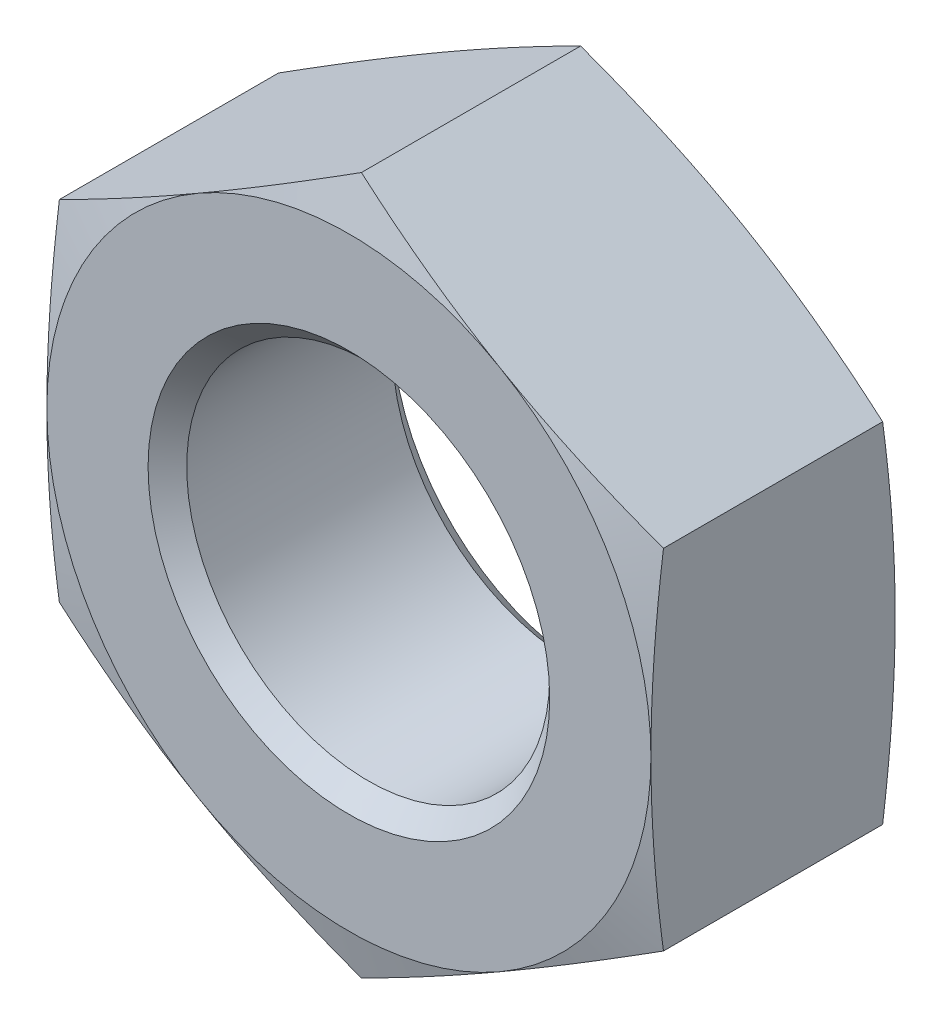
ISO-10303-21;
HEADER;
FILE_DESCRIPTION(('STEP AP214'),'2;1');
FILE_NAME('part.step','',(''),(''),'','','');
FILE_SCHEMA(('AUTOMOTIVE_DESIGN { 1 0 10303 214 1 1 1 1 }'));
ENDSEC;
DATA;
#1=APPLICATION_CONTEXT('core data for automotive mechanical design processes');
#2=APPLICATION_PROTOCOL_DEFINITION('international standard','automotive_design',2000,#1);
#3=PRODUCT_CONTEXT('',#1,'mechanical');
#4=PRODUCT('Part','Part','',(#3));
#5=PRODUCT_RELATED_PRODUCT_CATEGORY('part','',(#4));
#6=PRODUCT_DEFINITION_FORMATION('','',#4);
#7=PRODUCT_DEFINITION_CONTEXT('part definition',#1,'design');
#8=PRODUCT_DEFINITION('design','',#6,#7);
#9=PRODUCT_DEFINITION_SHAPE('','',#8);
#10=(LENGTH_UNIT() NAMED_UNIT(*) SI_UNIT(.MILLI.,.METRE.));
#11=(NAMED_UNIT(*) PLANE_ANGLE_UNIT() SI_UNIT($,.RADIAN.));
#12=(NAMED_UNIT(*) SI_UNIT($,.STERADIAN.) SOLID_ANGLE_UNIT());
#13=UNCERTAINTY_MEASURE_WITH_UNIT(LENGTH_MEASURE(1.E-05),#10,'distance_accuracy_value','');
#14=(GEOMETRIC_REPRESENTATION_CONTEXT(3) GLOBAL_UNCERTAINTY_ASSIGNED_CONTEXT((#13)) GLOBAL_UNIT_ASSIGNED_CONTEXT((#10,
#11,#12)) REPRESENTATION_CONTEXT('',''));
#15=CARTESIAN_POINT('',(0.,0.,0.));
#16=DIRECTION('',(0.,0.,1.));
#17=DIRECTION('',(1.,0.,0.));
#18=AXIS2_PLACEMENT_3D('',#15,#16,#17);
#19=CARTESIAN_POINT('',(0.,0.,0.));
#20=DIRECTION('',(0.,0.,-1.));
#21=DIRECTION('',(-1.,0.,0.));
#22=AXIS2_PLACEMENT_3D('',#19,#20,#21);
#23=PLANE('',#22);
#24=CARTESIAN_POINT('',(0.,0.,0.));
#25=DIRECTION('',(0.,0.,1.));
#26=DIRECTION('',(1.,0.,0.));
#27=AXIS2_PLACEMENT_3D('',#24,#25,#26);
#28=CIRCLE('',#27,11.938);
#29=CARTESIAN_POINT('',(11.938,0.,0.));
#30=VERTEX_POINT('',#29);
#31=CARTESIAN_POINT('',(5.96900000000041,10.3386112703787,0.));
#32=VERTEX_POINT('',#31);
#33=EDGE_CURVE('E11',#30,#32,#28,.T.);
#34=ORIENTED_EDGE('',*,*,#33,.T.);
#35=CARTESIAN_POINT('',(-5.96900000000041,10.3386112703787,0.));
#36=VERTEX_POINT('',#35);
#37=EDGE_CURVE('E46',#32,#36,#28,.T.);
#38=ORIENTED_EDGE('',*,*,#37,.T.);
#39=CARTESIAN_POINT('',(-11.938,0.,0.));
#40=VERTEX_POINT('',#39);
#41=EDGE_CURVE('E330',#36,#40,#28,.T.);
#42=ORIENTED_EDGE('',*,*,#41,.T.);
#43=CARTESIAN_POINT('',(-5.96900000000041,-10.3386112703787,0.));
#44=VERTEX_POINT('',#43);
#45=EDGE_CURVE('E329',#40,#44,#28,.T.);
#46=ORIENTED_EDGE('',*,*,#45,.T.);
#47=CARTESIAN_POINT('',(5.96900000000041,-10.3386112703787,0.));
#48=VERTEX_POINT('',#47);
#49=EDGE_CURVE('E323',#44,#48,#28,.T.);
#50=ORIENTED_EDGE('',*,*,#49,.T.);
#51=EDGE_CURVE('E47',#48,#30,#28,.T.);
#52=ORIENTED_EDGE('',*,*,#51,.T.);
#53=EDGE_LOOP('',(#34,#38,#42,#46,#50,#52));
#54=FACE_BOUND('',#53,.T.);
#55=CARTESIAN_POINT('',(0.,0.,0.));
#56=DIRECTION('',(0.,0.,1.));
#57=DIRECTION('',(1.,0.,0.));
#58=AXIS2_PLACEMENT_3D('',#55,#56,#57);
#59=CIRCLE('',#58,7.9375);
#60=CARTESIAN_POINT('',(7.9375,0.,0.));
#61=VERTEX_POINT('',#60);
#62=EDGE_CURVE('E188',#61,#61,#59,.T.);
#63=ORIENTED_EDGE('',*,*,#62,.F.);
#64=EDGE_LOOP('',(#63));
#65=FACE_BOUND('',#64,.T.);
#66=ADVANCED_FACE('F39',(#54,#65),#23,.F.);
#67=CARTESIAN_POINT('',(0.,11.938,-9.652));
#68=DIRECTION('',(0.,0.,1.));
#69=DIRECTION('',(1.,0.,0.));
#70=AXIS2_PLACEMENT_3D('',#67,#68,#69);
#71=PLANE('',#70);
#72=CARTESIAN_POINT('',(0.,0.,-9.652));
#73=DIRECTION('',(0.,0.,1.));
#74=DIRECTION('',(1.,0.,0.));
#75=AXIS2_PLACEMENT_3D('',#72,#73,#74);
#76=CIRCLE('',#75,11.938);
#77=CARTESIAN_POINT('',(11.938,0.,-9.652));
#78=VERTEX_POINT('',#77);
#79=CARTESIAN_POINT('',(5.96900000000041,10.3386112703787,-9.652));
#80=VERTEX_POINT('',#79);
#81=EDGE_CURVE('E326',#78,#80,#76,.T.);
#82=ORIENTED_EDGE('',*,*,#81,.F.);
#83=CARTESIAN_POINT('',(5.96900000000041,-10.3386112703787,-9.652));
#84=VERTEX_POINT('',#83);
#85=EDGE_CURVE('E362',#84,#78,#76,.T.);
#86=ORIENTED_EDGE('',*,*,#85,.F.);
#87=CARTESIAN_POINT('',(-5.96900000000041,-10.3386112703787,-9.652));
#88=VERTEX_POINT('',#87);
#89=EDGE_CURVE('E146',#88,#84,#76,.T.);
#90=ORIENTED_EDGE('',*,*,#89,.F.);
#91=CARTESIAN_POINT('',(-11.938,0.,-9.652));
#92=VERTEX_POINT('',#91);
#93=EDGE_CURVE('E360',#92,#88,#76,.T.);
#94=ORIENTED_EDGE('',*,*,#93,.F.);
#95=CARTESIAN_POINT('',(-5.96900000000041,10.3386112703787,-9.652));
#96=VERTEX_POINT('',#95);
#97=EDGE_CURVE('E356',#96,#92,#76,.T.);
#98=ORIENTED_EDGE('',*,*,#97,.F.);
#99=EDGE_CURVE('E359',#80,#96,#76,.T.);
#100=ORIENTED_EDGE('',*,*,#99,.F.);
#101=EDGE_LOOP('',(#82,#86,#90,#94,#98,#100));
#102=FACE_BOUND('',#101,.T.);
#103=CARTESIAN_POINT('',(0.,0.,-9.652));
#104=DIRECTION('',(0.,0.,1.));
#105=DIRECTION('',(1.,0.,0.));
#106=AXIS2_PLACEMENT_3D('',#103,#104,#105);
#107=CIRCLE('',#106,7.9375);
#108=CARTESIAN_POINT('',(7.9375,0.,-9.652));
#109=VERTEX_POINT('',#108);
#110=EDGE_CURVE('E208',#109,#109,#107,.T.);
#111=ORIENTED_EDGE('',*,*,#110,.T.);
#112=EDGE_LOOP('',(#111));
#113=FACE_BOUND('',#112,.T.);
#114=ADVANCED_FACE('F212',(#102,#113),#71,.F.);
#115=CARTESIAN_POINT('',(0.,0.,-0.63975549184855));
#116=DIRECTION('',(0.,0.,-1.));
#117=DIRECTION('',(-1.,0.,0.));
#118=AXIS2_PLACEMENT_3D('',#115,#116,#117);
#119=CONICAL_SURFACE('',#118,14.3256,1.30899693899575);
#120=CARTESIAN_POINT('',(-11.938,-18.2329624239488,-2.64077400679266));
#121=CARTESIAN_POINT('',(-11.938,-17.6913696744449,-2.51939633949655));
#122=CARTESIAN_POINT('',(-11.938,-17.1494381756858,-2.39950312660577));
#123=CARTESIAN_POINT('',(-11.938,-16.0647313152317,-2.16348688179615));
#124=CARTESIAN_POINT('',(-11.938,-15.5219559181492,-2.04736401270748));
#125=CARTESIAN_POINT('',(-11.938,-14.434908682187,-1.81958867359742));
#126=CARTESIAN_POINT('',(-11.938,-13.890635897666,-1.70794070054803));
#127=CARTESIAN_POINT('',(-11.938,-12.8009574769211,-1.49032027214938));
#128=CARTESIAN_POINT('',(-11.938,-12.2555518502985,-1.38434776889991));
#129=CARTESIAN_POINT('',(-11.938,-11.1677674045129,-1.180247795952));
#130=CARTESIAN_POINT('',(-11.938,-10.6253991053055,-1.08206453394043));
#131=CARTESIAN_POINT('',(-11.938,-9.53916914199247,-0.894267340335431));
#132=CARTESIAN_POINT('',(-11.938,-8.99530747234857,-0.804653440566647));
#133=CARTESIAN_POINT('',(-11.938,-7.90600608674276,-0.636016702342263));
#134=CARTESIAN_POINT('',(-11.938,-7.36056659561774,-0.556992424159846));
#135=CARTESIAN_POINT('',(-11.938,-6.26795191717734,-0.41186228925882));
#136=CARTESIAN_POINT('',(-11.938,-5.72077672823634,-0.345756444642916));
#137=CARTESIAN_POINT('',(-11.938,-4.61851750236025,-0.22833505716445));
#138=CARTESIAN_POINT('',(-11.938,-4.06341433526461,-0.177196428128624));
#139=CARTESIAN_POINT('',(-11.938,-2.95181246319246,-0.093237299613816));
#140=CARTESIAN_POINT('',(-11.938,-2.39531379051455,-0.0604163800361554));
#141=CARTESIAN_POINT('',(-11.938,-1.28172815967689,-0.0150069189123938));
#142=CARTESIAN_POINT('',(-11.938,-0.724641584147543,-0.00240918301811301));
#143=CARTESIAN_POINT('',(-11.938,0.389611681402445,0.00177937722295485));
#144=CARTESIAN_POINT('',(-11.938,0.946778371353608,-0.00662978032144065));
#145=CARTESIAN_POINT('',(-11.938,2.06243645780666,-0.043982106061553));
#146=CARTESIAN_POINT('',(-11.938,2.62092530818588,-0.0729998002341817));
#147=CARTESIAN_POINT('',(-11.938,3.73658957414119,-0.149912821281346));
#148=CARTESIAN_POINT('',(-11.938,4.29376496036378,-0.197808566096605));
#149=CARTESIAN_POINT('',(-11.938,5.40679760797117,-0.310058338560213));
#150=CARTESIAN_POINT('',(-11.938,5.96265376929824,-0.374423106966597));
#151=CARTESIAN_POINT('',(-11.938,7.07257721361171,-0.516932618400637));
#152=CARTESIAN_POINT('',(-11.938,7.6266444909761,-0.595077404692646));
#153=CARTESIAN_POINT('',(-11.938,8.69641690113728,-0.757099427124152));
#154=CARTESIAN_POINT('',(-11.938,9.2122325547304,-0.840254303029304));
#155=CARTESIAN_POINT('',(-11.938,10.2425044503579,-1.01463514239579));
#156=CARTESIAN_POINT('',(-11.938,10.756960654909,-1.10586132605987));
#157=CARTESIAN_POINT('',(-11.938,11.7847069043095,-1.294911442235));
#158=CARTESIAN_POINT('',(-11.938,12.2979968264722,-1.39273603840907));
#159=CARTESIAN_POINT('',(-11.938,13.3235130283692,-1.59376697507529));
#160=CARTESIAN_POINT('',(-11.938,13.8357393176846,-1.69697326686994));
#161=CARTESIAN_POINT('',(-11.938,14.8594024070828,-1.90782005277345));
#162=CARTESIAN_POINT('',(-11.938,15.3708389914757,-2.01546159118339));
#163=CARTESIAN_POINT('',(-11.938,16.3929337232113,-2.23438433972006));
#164=CARTESIAN_POINT('',(-11.938,16.9035918660093,-2.34566557101054));
#165=CARTESIAN_POINT('',(-11.938,18.4345039483056,-2.68398646998532));
#166=CARTESIAN_POINT('',(-11.938,19.4537648727735,-2.91551781315897));
#167=CARTESIAN_POINT('',(-11.938,21.4803337058259,-3.38462009781527));
#168=CARTESIAN_POINT('',(-11.938,22.4876606512493,-3.62210933510761));
#169=CARTESIAN_POINT('',(-11.938,24.5009106019141,-4.10303560183728));
#170=CARTESIAN_POINT('',(-11.938,25.5068335812256,-4.34647273962938));
#171=CARTESIAN_POINT('',(-11.938,27.5163606552524,-4.83744827983636));
#172=CARTESIAN_POINT('',(-11.938,28.5199660796916,-5.08498125046663));
#173=CARTESIAN_POINT('',(-11.938,30.0247344667876,-5.45878236337262));
#174=CARTESIAN_POINT('',(-11.938,30.5262092376269,-5.58379764478769));
#175=CARTESIAN_POINT('',(-11.938,31.5289734668439,-5.83456702953237));
#176=CARTESIAN_POINT('',(-11.938,32.0302629254207,-5.96032113206533));
#177=CARTESIAN_POINT('',(-11.938,32.531471539357,-6.08639660660485));
#178=B_SPLINE_CURVE_WITH_KNOTS('',3,(#120,#121,#122,#123,#124,#125,#126,#127,#128,#129,#130,
#131,#132,#133,#134,#135,#136,#137,#138,#139,#140,#141,#142,#143,#144,#145,#146,#147,#148,#149,
#150,#151,#152,#153,#154,#155,#156,#157,#158,#159,#160,#161,#162,#163,#164,#165,#166,#167,#168,
#169,#170,#171,#172,#173,#174,#175,#176,#177),.UNSPECIFIED.,.F.,.F.,(4,2,2,2,2,2,2,2,2,2,2,2,2,
2,2,2,2,2,2,2,2,2,2,2,2,2,2,2,4),(0.,1.66508851645697,3.33024884784672,4.9970426158881,
6.66382231419357,8.31731808575057,9.97081999777277,11.6240968770559,13.2773753052131,
14.9494720185747,16.6215303824642,18.2928283396122,19.9641248560321,21.6414962055085,
23.3189046923561,24.9974099513293,26.6759204803055,28.243271107013,29.81066450763,
31.378215791163,32.9457528928094,34.5136612119763,36.0815786496928,39.2172010652111,
42.3220114684657,45.4268784752617,48.5279139911852,50.0783818372318,51.6288480117816),.UNSPECIFIED.);
#179=CARTESIAN_POINT('',(-11.938,-6.8924075135858,-0.494852595100275));
#180=VERTEX_POINT('',#179);
#181=EDGE_CURVE('E343',#180,#40,#178,.T.);
#182=ORIENTED_EDGE('',*,*,#181,.F.);
#183=CARTESIAN_POINT('',(0.0002,-13.7849304972258,-0.494883535596833));
#184=CARTESIAN_POINT('',(-0.495571749626556,-13.4986965441223,-0.418156428695746));
#185=CARTESIAN_POINT('',(-0.992242367562172,-13.2119436291586,-0.348500973257741));
#186=CARTESIAN_POINT('',(-1.98733756842005,-12.637425147074,-0.226122985982818));
#187=CARTESIAN_POINT('',(-2.48576278086814,-12.3496592164961,-0.173407331405825));
#188=CARTESIAN_POINT('',(-3.48134533434232,-11.7748593612473,-0.0879863452068009));
#189=CARTESIAN_POINT('',(-3.97849594378939,-11.4878293230552,-0.0551791492140337));
#190=CARTESIAN_POINT('',(-4.97343112969185,-10.9134032256482,-0.0111880682381548));
#191=CARTESIAN_POINT('',(-5.47121556484592,-10.6260072480135,0.));
#192=CARTESIAN_POINT('',(-6.46678443515407,-10.0512152927443,0.));
#193=CARTESIAN_POINT('',(-6.96456887030814,-9.76381931510964,-0.0111880682381303));
#194=CARTESIAN_POINT('',(-7.9595040562106,-9.1893932177026,-0.0551791492139853));
#195=CARTESIAN_POINT('',(-8.45665466565767,-8.90236317951052,-0.087986345206741));
#196=CARTESIAN_POINT('',(-9.45223721913186,-8.32756332426167,-0.173407331405743));
#197=CARTESIAN_POINT('',(-9.95066243157995,-8.03979739368385,-0.226122985982727));
#198=CARTESIAN_POINT('',(-10.9457576324378,-7.46527891159921,-0.348500973257631));
#199=CARTESIAN_POINT('',(-11.4424282503734,-7.17852599663549,-0.418156428695627));
#200=CARTESIAN_POINT('',(-11.9382,-6.89229204353196,-0.494883535596707));
#201=B_SPLINE_CURVE_WITH_KNOTS('',3,(#183,#184,#185,#186,#187,#188,#189,#190,#191,#192,#193,
#194,#195,#196,#197,#198,#199,#200),.UNSPECIFIED.,.F.,.F.,(4,2,2,2,2,2,2,2,4),(0.,
1.73285128625862,3.46640519332184,5.19101265399724,6.91528637338861,8.63956009277998,
10.3641675534554,12.0977214605186,13.8305727467772),.UNSPECIFIED.);
#202=EDGE_CURVE('E157',#44,#180,#201,.T.);
#203=ORIENTED_EDGE('',*,*,#202,.F.);
#204=ORIENTED_EDGE('',*,*,#45,.F.);
#205=EDGE_LOOP('',(#182,#203,#204));
#206=FACE_BOUND('',#205,.T.);
#207=ADVANCED_FACE('F230',(#206),#119,.T.);
#208=CARTESIAN_POINT('',(-11.938,6.8924075135858,-0.494852595100275));
#209=VERTEX_POINT('',#208);
#210=EDGE_CURVE('E340',#40,#209,#178,.T.);
#211=ORIENTED_EDGE('',*,*,#210,.F.);
#212=ORIENTED_EDGE('',*,*,#41,.F.);
#213=CARTESIAN_POINT('',(-11.9382,6.89229204353196,-0.494883535596708));
#214=CARTESIAN_POINT('',(-11.4424282503734,7.17852599663549,-0.418156428695628));
#215=CARTESIAN_POINT('',(-10.9457576324378,7.46527891159921,-0.348500973257632));
#216=CARTESIAN_POINT('',(-9.95066243157995,8.03979739368385,-0.226122985982727));
#217=CARTESIAN_POINT('',(-9.45223721913185,8.32756332426167,-0.173407331405743));
#218=CARTESIAN_POINT('',(-8.45665466565767,8.90236317951052,-0.087986345206741));
#219=CARTESIAN_POINT('',(-7.9595040562106,9.18939321770259,-0.0551791492139855));
#220=CARTESIAN_POINT('',(-6.96456887030814,9.76381931510964,-0.0111880682381305));
#221=CARTESIAN_POINT('',(-6.46678443515407,10.0512152927443,0.));
#222=CARTESIAN_POINT('',(-5.47121556484592,10.6260072480135,0.));
#223=CARTESIAN_POINT('',(-4.97343112969185,10.9134032256482,-0.0111880682381549));
#224=CARTESIAN_POINT('',(-3.97849594378939,11.4878293230552,-0.0551791492140338));
#225=CARTESIAN_POINT('',(-3.48134533434232,11.7748593612473,-0.087986345206801));
#226=CARTESIAN_POINT('',(-2.48576278086814,12.3496592164961,-0.173407331405825));
#227=CARTESIAN_POINT('',(-1.98733756842005,12.637425147074,-0.226122985982818));
#228=CARTESIAN_POINT('',(-0.992242367562172,13.2119436291586,-0.348500973257741));
#229=CARTESIAN_POINT('',(-0.495571749626556,13.4986965441223,-0.418156428695746));
#230=CARTESIAN_POINT('',(0.000199999999999873,13.7849304972258,-0.494883535596833));
#231=B_SPLINE_CURVE_WITH_KNOTS('',3,(#213,#214,#215,#216,#217,#218,#219,#220,#221,#222,#223,
#224,#225,#226,#227,#228,#229,#230),.UNSPECIFIED.,.F.,.F.,(4,2,2,2,2,2,2,2,4),(0.,
1.73285128625863,3.46640519332185,5.19101265399724,6.91528637338862,8.63956009277999,
10.3641675534554,12.0977214605186,13.8305727467772),.UNSPECIFIED.);
#232=EDGE_CURVE('E268',#209,#36,#231,.T.);
#233=ORIENTED_EDGE('',*,*,#232,.F.);
#234=EDGE_LOOP('',(#211,#212,#233));
#235=FACE_BOUND('',#234,.T.);
#236=ADVANCED_FACE('F277',(#235),#119,.T.);
#237=CARTESIAN_POINT('',(0.,13.784815027172,-0.494852595100401));
#238=VERTEX_POINT('',#237);
#239=EDGE_CURVE('E263',#36,#238,#231,.T.);
#240=ORIENTED_EDGE('',*,*,#239,.F.);
#241=ORIENTED_EDGE('',*,*,#37,.F.);
#242=CARTESIAN_POINT('',(-0.0002,13.7849304972258,-0.494883535596833));
#243=CARTESIAN_POINT('',(0.495571749626556,13.4986965441223,-0.418156428695746));
#244=CARTESIAN_POINT('',(0.992242367562172,13.2119436291586,-0.348500973257741));
#245=CARTESIAN_POINT('',(1.98733756842005,12.637425147074,-0.226122985982818));
#246=CARTESIAN_POINT('',(2.48576278086814,12.3496592164961,-0.173407331405825));
#247=CARTESIAN_POINT('',(3.48134533434232,11.7748593612473,-0.0879863452068009));
#248=CARTESIAN_POINT('',(3.97849594378939,11.4878293230552,-0.0551791492140337));
#249=CARTESIAN_POINT('',(4.97343112969185,10.9134032256482,-0.0111880682381548));
#250=CARTESIAN_POINT('',(5.47121556484592,10.6260072480135,0.));
#251=CARTESIAN_POINT('',(6.46678443515407,10.0512152927443,0.));
#252=CARTESIAN_POINT('',(6.96456887030814,9.76381931510964,-0.0111880682381303));
#253=CARTESIAN_POINT('',(7.9595040562106,9.1893932177026,-0.0551791492139853));
#254=CARTESIAN_POINT('',(8.45665466565767,8.90236317951052,-0.087986345206741));
#255=CARTESIAN_POINT('',(9.45223721913186,8.32756332426167,-0.173407331405743));
#256=CARTESIAN_POINT('',(9.95066243157995,8.03979739368385,-0.226122985982727));
#257=CARTESIAN_POINT('',(10.9457576324378,7.46527891159921,-0.348500973257631));
#258=CARTESIAN_POINT('',(11.4424282503734,7.17852599663549,-0.418156428695627));
#259=CARTESIAN_POINT('',(11.9382,6.89229204353196,-0.494883535596707));
#260=B_SPLINE_CURVE_WITH_KNOTS('',3,(#242,#243,#244,#245,#246,#247,#248,#249,#250,#251,#252,
#253,#254,#255,#256,#257,#258,#259),.UNSPECIFIED.,.F.,.F.,(4,2,2,2,2,2,2,2,4),(0.,
1.73285128625862,3.46640519332184,5.19101265399724,6.91528637338861,8.63956009277998,
10.3641675534554,12.0977214605186,13.8305727467772),.UNSPECIFIED.);
#261=EDGE_CURVE('E295',#238,#32,#260,.T.);
#262=ORIENTED_EDGE('',*,*,#261,.F.);
#263=EDGE_LOOP('',(#240,#241,#262));
#264=FACE_BOUND('',#263,.T.);
#265=ADVANCED_FACE('F336',(#264),#119,.T.);
#266=CARTESIAN_POINT('',(11.938,6.8924075135858,-0.494852595100275));
#267=VERTEX_POINT('',#266);
#268=EDGE_CURVE('E291',#32,#267,#260,.T.);
#269=ORIENTED_EDGE('',*,*,#268,.F.);
#270=ORIENTED_EDGE('',*,*,#33,.F.);
#271=CARTESIAN_POINT('',(11.938,-18.2329624239488,-2.64077400679266));
#272=CARTESIAN_POINT('',(11.938,-17.6913696744449,-2.51939633949655));
#273=CARTESIAN_POINT('',(11.938,-17.1494381756858,-2.39950312660577));
#274=CARTESIAN_POINT('',(11.938,-16.0647313152317,-2.16348688179615));
#275=CARTESIAN_POINT('',(11.938,-15.5219559181492,-2.04736401270748));
#276=CARTESIAN_POINT('',(11.938,-14.434908682187,-1.81958867359742));
#277=CARTESIAN_POINT('',(11.938,-13.890635897666,-1.70794070054803));
#278=CARTESIAN_POINT('',(11.938,-12.8009574769211,-1.49032027214938));
#279=CARTESIAN_POINT('',(11.938,-12.2555518502985,-1.38434776889991));
#280=CARTESIAN_POINT('',(11.938,-11.1677674045129,-1.180247795952));
#281=CARTESIAN_POINT('',(11.938,-10.6253991053055,-1.08206453394043));
#282=CARTESIAN_POINT('',(11.938,-9.53916914199247,-0.894267340335431));
#283=CARTESIAN_POINT('',(11.938,-8.99530747234857,-0.804653440566647));
#284=CARTESIAN_POINT('',(11.938,-7.90600608674276,-0.636016702342263));
#285=CARTESIAN_POINT('',(11.938,-7.36056659561774,-0.556992424159846));
#286=CARTESIAN_POINT('',(11.938,-6.26795191717734,-0.41186228925882));
#287=CARTESIAN_POINT('',(11.938,-5.72077672823634,-0.345756444642916));
#288=CARTESIAN_POINT('',(11.938,-4.61851750236025,-0.22833505716445));
#289=CARTESIAN_POINT('',(11.938,-4.06341433526461,-0.177196428128624));
#290=CARTESIAN_POINT('',(11.938,-2.95181246319246,-0.093237299613816));
#291=CARTESIAN_POINT('',(11.938,-2.39531379051455,-0.0604163800361554));
#292=CARTESIAN_POINT('',(11.938,-1.28172815967689,-0.0150069189123938));
#293=CARTESIAN_POINT('',(11.938,-0.724641584147543,-0.00240918301811301));
#294=CARTESIAN_POINT('',(11.938,0.389611681402445,0.00177937722295485));
#295=CARTESIAN_POINT('',(11.938,0.946778371353608,-0.00662978032144065));
#296=CARTESIAN_POINT('',(11.938,2.06243645780666,-0.043982106061553));
#297=CARTESIAN_POINT('',(11.938,2.62092530818588,-0.0729998002341817));
#298=CARTESIAN_POINT('',(11.938,3.73658957414119,-0.149912821281346));
#299=CARTESIAN_POINT('',(11.938,4.29376496036378,-0.197808566096605));
#300=CARTESIAN_POINT('',(11.938,5.40679760797117,-0.310058338560213));
#301=CARTESIAN_POINT('',(11.938,5.96265376929824,-0.374423106966597));
#302=CARTESIAN_POINT('',(11.938,7.07257721361171,-0.516932618400637));
#303=CARTESIAN_POINT('',(11.938,7.6266444909761,-0.595077404692646));
#304=CARTESIAN_POINT('',(11.938,8.69641690113728,-0.757099427124152));
#305=CARTESIAN_POINT('',(11.938,9.2122325547304,-0.840254303029304));
#306=CARTESIAN_POINT('',(11.938,10.2425044503579,-1.01463514239579));
#307=CARTESIAN_POINT('',(11.938,10.756960654909,-1.10586132605987));
#308=CARTESIAN_POINT('',(11.938,11.7847069043095,-1.294911442235));
#309=CARTESIAN_POINT('',(11.938,12.2979968264722,-1.39273603840907));
#310=CARTESIAN_POINT('',(11.938,13.3235130283692,-1.59376697507529));
#311=CARTESIAN_POINT('',(11.938,13.8357393176846,-1.69697326686994));
#312=CARTESIAN_POINT('',(11.938,14.8594024070828,-1.90782005277345));
#313=CARTESIAN_POINT('',(11.938,15.3708389914757,-2.01546159118339));
#314=CARTESIAN_POINT('',(11.938,16.3929337232113,-2.23438433972006));
#315=CARTESIAN_POINT('',(11.938,16.9035918660093,-2.34566557101054));
#316=CARTESIAN_POINT('',(11.938,18.4345039483056,-2.68398646998532));
#317=CARTESIAN_POINT('',(11.938,19.4537648727735,-2.91551781315897));
#318=CARTESIAN_POINT('',(11.938,21.4803337058259,-3.38462009781527));
#319=CARTESIAN_POINT('',(11.938,22.4876606512493,-3.62210933510761));
#320=CARTESIAN_POINT('',(11.938,24.5009106019141,-4.10303560183728));
#321=CARTESIAN_POINT('',(11.938,25.5068335812256,-4.34647273962938));
#322=CARTESIAN_POINT('',(11.938,27.5163606552524,-4.83744827983636));
#323=CARTESIAN_POINT('',(11.938,28.5199660796916,-5.08498125046663));
#324=CARTESIAN_POINT('',(11.938,30.0247344667876,-5.45878236337262));
#325=CARTESIAN_POINT('',(11.938,30.5262092376269,-5.58379764478769));
#326=CARTESIAN_POINT('',(11.938,31.5289734668439,-5.83456702953237));
#327=CARTESIAN_POINT('',(11.938,32.0302629254207,-5.96032113206533));
#328=CARTESIAN_POINT('',(11.938,32.531471539357,-6.08639660660485));
#329=B_SPLINE_CURVE_WITH_KNOTS('',3,(#271,#272,#273,#274,#275,#276,#277,#278,#279,#280,#281,
#282,#283,#284,#285,#286,#287,#288,#289,#290,#291,#292,#293,#294,#295,#296,#297,#298,#299,#300,
#301,#302,#303,#304,#305,#306,#307,#308,#309,#310,#311,#312,#313,#314,#315,#316,#317,#318,#319,
#320,#321,#322,#323,#324,#325,#326,#327,#328),.UNSPECIFIED.,.F.,.F.,(4,2,2,2,2,2,2,2,2,2,2,2,2,
2,2,2,2,2,2,2,2,2,2,2,2,2,2,2,4),(0.,1.66508851645697,3.33024884784672,4.9970426158881,
6.66382231419357,8.31731808575057,9.97081999777277,11.6240968770559,13.2773753052131,
14.9494720185747,16.6215303824642,18.2928283396122,19.9641248560321,21.6414962055085,
23.3189046923561,24.9974099513293,26.6759204803055,28.243271107013,29.81066450763,
31.378215791163,32.9457528928094,34.5136612119763,36.0815786496928,39.2172010652111,
42.3220114684657,45.4268784752617,48.5279139911852,50.0783818372318,51.6288480117816),.UNSPECIFIED.);
#330=EDGE_CURVE('E301',#267,#30,#329,.F.);
#331=ORIENTED_EDGE('',*,*,#330,.F.);
#332=EDGE_LOOP('',(#269,#270,#331));
#333=FACE_BOUND('',#332,.T.);
#334=ADVANCED_FACE('F377',(#333),#119,.T.);
#335=CARTESIAN_POINT('',(11.938,-6.8924075135858,-0.494852595100275));
#336=VERTEX_POINT('',#335);
#337=EDGE_CURVE('E286',#30,#336,#329,.F.);
#338=ORIENTED_EDGE('',*,*,#337,.F.);
#339=ORIENTED_EDGE('',*,*,#51,.F.);
#340=CARTESIAN_POINT('',(11.9382,-6.89229204353196,-0.494883535596708));
#341=CARTESIAN_POINT('',(11.4424282503734,-7.17852599663549,-0.418156428695628));
#342=CARTESIAN_POINT('',(10.9457576324378,-7.46527891159921,-0.348500973257632));
#343=CARTESIAN_POINT('',(9.95066243157995,-8.03979739368385,-0.226122985982727));
#344=CARTESIAN_POINT('',(9.45223721913185,-8.32756332426167,-0.173407331405743));
#345=CARTESIAN_POINT('',(8.45665466565767,-8.90236317951052,-0.087986345206741));
#346=CARTESIAN_POINT('',(7.9595040562106,-9.18939321770259,-0.0551791492139855));
#347=CARTESIAN_POINT('',(6.96456887030814,-9.76381931510964,-0.0111880682381305));
#348=CARTESIAN_POINT('',(6.46678443515407,-10.0512152927443,0.));
#349=CARTESIAN_POINT('',(5.47121556484592,-10.6260072480135,0.));
#350=CARTESIAN_POINT('',(4.97343112969185,-10.9134032256482,-0.0111880682381549));
#351=CARTESIAN_POINT('',(3.97849594378939,-11.4878293230552,-0.0551791492140338));
#352=CARTESIAN_POINT('',(3.48134533434232,-11.7748593612473,-0.087986345206801));
#353=CARTESIAN_POINT('',(2.48576278086814,-12.3496592164961,-0.173407331405825));
#354=CARTESIAN_POINT('',(1.98733756842005,-12.637425147074,-0.226122985982818));
#355=CARTESIAN_POINT('',(0.992242367562172,-13.2119436291586,-0.348500973257741));
#356=CARTESIAN_POINT('',(0.495571749626556,-13.4986965441223,-0.418156428695746));
#357=CARTESIAN_POINT('',(-0.000199999999999873,-13.7849304972258,-0.494883535596833));
#358=B_SPLINE_CURVE_WITH_KNOTS('',3,(#340,#341,#342,#343,#344,#345,#346,#347,#348,#349,#350,
#351,#352,#353,#354,#355,#356,#357),.UNSPECIFIED.,.F.,.F.,(4,2,2,2,2,2,2,2,4),(0.,
1.73285128625863,3.46640519332185,5.19101265399724,6.91528637338862,8.63956009277999,
10.3641675534554,12.0977214605186,13.8305727467772),.UNSPECIFIED.);
#359=EDGE_CURVE('E149',#336,#48,#358,.T.);
#360=ORIENTED_EDGE('',*,*,#359,.F.);
#361=EDGE_LOOP('',(#338,#339,#360));
#362=FACE_BOUND('',#361,.T.);
#363=ADVANCED_FACE('F325',(#362),#119,.T.);
#364=CARTESIAN_POINT('',(0.,-13.784815027172,-0.494852595100401));
#365=VERTEX_POINT('',#364);
#366=EDGE_CURVE('E141',#48,#365,#358,.T.);
#367=ORIENTED_EDGE('',*,*,#366,.F.);
#368=ORIENTED_EDGE('',*,*,#49,.F.);
#369=EDGE_CURVE('E54',#365,#44,#201,.T.);
#370=ORIENTED_EDGE('',*,*,#369,.F.);
#371=EDGE_LOOP('',(#367,#368,#370));
#372=FACE_BOUND('',#371,.T.);
#373=ADVANCED_FACE('F279',(#372),#119,.T.);
#374=CARTESIAN_POINT('',(-11.938,6.8924075135858,-9.652));
#375=DIRECTION('',(-1.,0.,0.));
#376=DIRECTION('',(0.,0.,1.));
#377=AXIS2_PLACEMENT_3D('',#374,#375,#376);
#378=PLANE('',#377);
#379=ORIENTED_EDGE('',*,*,#181,.T.);
#380=ORIENTED_EDGE('',*,*,#210,.T.);
#381=DIRECTION('',(0.,0.,1.));
#382=VECTOR('',#381,1.);
#383=CARTESIAN_POINT('',(-11.938,6.8924075135858,-9.652));
#384=LINE('',#383,#382);
#385=CARTESIAN_POINT('',(-11.938,6.8924075135858,-9.15714740489976));
#386=VERTEX_POINT('',#385);
#387=EDGE_CURVE('E134',#386,#209,#384,.T.);
#388=ORIENTED_EDGE('',*,*,#387,.F.);
#389=CARTESIAN_POINT('',(-11.938,-18.2329624239488,-7.01122599320756));
#390=CARTESIAN_POINT('',(-11.938,-17.6913696744449,-7.13260366050366));
#391=CARTESIAN_POINT('',(-11.938,-17.1494381756858,-7.25249687339443));
#392=CARTESIAN_POINT('',(-11.938,-16.0647313152317,-7.48851311820403));
#393=CARTESIAN_POINT('',(-11.938,-15.5219559181492,-7.60463598729269));
#394=CARTESIAN_POINT('',(-11.938,-14.434908682187,-7.83241132640272));
#395=CARTESIAN_POINT('',(-11.938,-13.890635897666,-7.94405929945211));
#396=CARTESIAN_POINT('',(-11.938,-12.800957476921,-8.16167972785074));
#397=CARTESIAN_POINT('',(-11.938,-12.2555518502984,-8.2676522311002));
#398=CARTESIAN_POINT('',(-11.938,-11.1677674045129,-8.47175220404809));
#399=CARTESIAN_POINT('',(-11.938,-10.6253991053055,-8.56993546605966));
#400=CARTESIAN_POINT('',(-11.938,-9.53916914199246,-8.75773265966464));
#401=CARTESIAN_POINT('',(-11.938,-8.99530747234856,-8.84734655943342));
#402=CARTESIAN_POINT('',(-11.938,-7.90600608674275,-9.01598329765779));
#403=CARTESIAN_POINT('',(-11.938,-7.36056659561774,-9.0950075758402));
#404=CARTESIAN_POINT('',(-11.938,-6.26795191717734,-9.24013771074121));
#405=CARTESIAN_POINT('',(-11.938,-5.72077672823634,-9.30624355535711));
#406=CARTESIAN_POINT('',(-11.938,-4.61851750236025,-9.42366494283557));
#407=CARTESIAN_POINT('',(-11.938,-4.0634143352646,-9.47480357187139));
#408=CARTESIAN_POINT('',(-11.938,-2.95181246319246,-9.55876270038619));
#409=CARTESIAN_POINT('',(-11.938,-2.39531379051455,-9.59158361996385));
#410=CARTESIAN_POINT('',(-11.938,-1.2817281596769,-9.63699308108761));
#411=CARTESIAN_POINT('',(-11.938,-0.724641584147557,-9.64959081698189));
#412=CARTESIAN_POINT('',(-11.938,0.389611681402426,-9.65377937722295));
#413=CARTESIAN_POINT('',(-11.938,0.946778371353587,-9.64537021967856));
#414=CARTESIAN_POINT('',(-11.938,2.06243645780664,-9.60801789393845));
#415=CARTESIAN_POINT('',(-11.938,2.62092530818585,-9.57900019976582));
#416=CARTESIAN_POINT('',(-11.938,3.73658957414116,-9.50208717871867));
#417=CARTESIAN_POINT('',(-11.938,4.29376496036374,-9.45419143390341));
#418=CARTESIAN_POINT('',(-11.938,5.40679760797113,-9.34194166143982));
#419=CARTESIAN_POINT('',(-11.938,5.9626537692982,-9.27757689303344));
#420=CARTESIAN_POINT('',(-11.938,7.07257721361167,-9.13506738159941));
#421=CARTESIAN_POINT('',(-11.938,7.62664449097604,-9.05692259530741));
#422=CARTESIAN_POINT('',(-11.938,8.69641690113723,-8.89490057287592));
#423=CARTESIAN_POINT('',(-11.938,9.21223255473035,-8.81174569697077));
#424=CARTESIAN_POINT('',(-11.938,10.2425044503579,-8.6373648576043));
#425=CARTESIAN_POINT('',(-11.938,10.756960654909,-8.54613867394023));
#426=CARTESIAN_POINT('',(-11.938,11.7847069043094,-8.35708855776511));
#427=CARTESIAN_POINT('',(-11.938,12.2979968264721,-8.25926396159105));
#428=CARTESIAN_POINT('',(-11.938,13.3235130283692,-8.05823302492485));
#429=CARTESIAN_POINT('',(-11.938,13.8357393176845,-7.9550267331302));
#430=CARTESIAN_POINT('',(-11.938,14.8594024070828,-7.74417994722672));
#431=CARTESIAN_POINT('',(-11.938,15.3708389914757,-7.63653840881679));
#432=CARTESIAN_POINT('',(-11.938,16.3929337232112,-7.41761566028013));
#433=CARTESIAN_POINT('',(-11.938,16.9035918660093,-7.30633442898966));
#434=CARTESIAN_POINT('',(-11.938,18.4345039483056,-6.9680135300149));
#435=CARTESIAN_POINT('',(-11.938,19.4537648727734,-6.73648218684127));
#436=CARTESIAN_POINT('',(-11.938,21.4803337058259,-6.26737990218501));
#437=CARTESIAN_POINT('',(-11.938,22.4876606512493,-6.02989066489269));
#438=CARTESIAN_POINT('',(-11.938,24.5009106019141,-5.54896439816306));
#439=CARTESIAN_POINT('',(-11.938,25.5068335812256,-5.30552726037097));
#440=CARTESIAN_POINT('',(-11.938,27.5163606552524,-4.81455172016403));
#441=CARTESIAN_POINT('',(-11.938,28.5199660796916,-4.56701874953378));
#442=CARTESIAN_POINT('',(-11.938,30.0247344667876,-4.19321763662782));
#443=CARTESIAN_POINT('',(-11.938,30.5262092376269,-4.06820235521276));
#444=CARTESIAN_POINT('',(-11.938,31.5289734668439,-3.8174329704681));
#445=CARTESIAN_POINT('',(-11.938,32.0302629254207,-3.69167886793515));
#446=CARTESIAN_POINT('',(-11.938,32.531471539357,-3.56560339339564));
#447=B_SPLINE_CURVE_WITH_KNOTS('',3,(#389,#390,#391,#392,#393,#394,#395,#396,#397,#398,#399,
#400,#401,#402,#403,#404,#405,#406,#407,#408,#409,#410,#411,#412,#413,#414,#415,#416,#417,#418,
#419,#420,#421,#422,#423,#424,#425,#426,#427,#428,#429,#430,#431,#432,#433,#434,#435,#436,#437,
#438,#439,#440,#441,#442,#443,#444,#445,#446),.UNSPECIFIED.,.F.,.F.,(4,2,2,2,2,2,2,2,2,2,2,2,2,
2,2,2,2,2,2,2,2,2,2,2,2,2,2,2,4),(0.,1.66508851645697,3.33024884784671,4.99704261588808,
6.66382231419355,8.31731808575055,9.97081999777274,11.6240968770558,13.2773753052131,
14.9494720185747,16.6215303824642,18.2928283396121,19.9641248560321,21.6414962055084,
23.318904692356,24.9974099513292,26.6759204803054,28.2432711070129,29.8106645076299,
31.3782157911629,32.9457528928093,34.5136612119762,36.0815786496927,39.217201065211,
42.3220114684656,45.4268784752615,48.5279139911851,50.0783818372317,51.6288480117815),.UNSPECIFIED.);
#448=EDGE_CURVE('E344',#386,#92,#447,.F.);
#449=ORIENTED_EDGE('',*,*,#448,.T.);
#450=CARTESIAN_POINT('',(-11.938,-6.8924075135858,-9.15714740489976));
#451=VERTEX_POINT('',#450);
#452=EDGE_CURVE('E270',#92,#451,#447,.F.);
#453=ORIENTED_EDGE('',*,*,#452,.T.);
#454=DIRECTION('',(0.,0.,1.));
#455=VECTOR('',#454,1.);
#456=CARTESIAN_POINT('',(-11.938,-6.8924075135858,-9.652));
#457=LINE('',#456,#455);
#458=EDGE_CURVE('E143',#451,#180,#457,.T.);
#459=ORIENTED_EDGE('',*,*,#458,.T.);
#460=EDGE_LOOP('',(#379,#380,#388,#449,#453,#459));
#461=FACE_BOUND('',#460,.T.);
#462=ADVANCED_FACE('F180',(#461),#378,.T.);
#463=CARTESIAN_POINT('',(0.,13.784815027172,-9.652));
#464=DIRECTION('',(-0.500000000000024,0.866025403784425,0.));
#465=DIRECTION('',(-0.866025403784425,-0.500000000000024,0.));
#466=AXIS2_PLACEMENT_3D('',#463,#464,#465);
#467=PLANE('',#466);
#468=ORIENTED_EDGE('',*,*,#232,.T.);
#469=ORIENTED_EDGE('',*,*,#239,.T.);
#470=DIRECTION('',(0.,0.,1.));
#471=VECTOR('',#470,1.);
#472=CARTESIAN_POINT('',(0.,13.784815027172,-9.652));
#473=LINE('',#472,#471);
#474=CARTESIAN_POINT('',(0.,13.784815027172,-9.15714740489964));
#475=VERTEX_POINT('',#474);
#476=EDGE_CURVE('E195',#475,#238,#473,.T.);
#477=ORIENTED_EDGE('',*,*,#476,.F.);
#478=CARTESIAN_POINT('',(0.0002,13.7849304972258,-9.15711646440321));
#479=CARTESIAN_POINT('',(-0.495571749626558,13.4986965441223,-9.23384357130429));
#480=CARTESIAN_POINT('',(-0.992242367562173,13.2119436291586,-9.30349902674229));
#481=CARTESIAN_POINT('',(-1.98733756842005,12.637425147074,-9.4258770140172));
#482=CARTESIAN_POINT('',(-2.48576278086814,12.3496592164961,-9.47859266859419));
#483=CARTESIAN_POINT('',(-3.48134533434232,11.7748593612473,-9.56401365479321));
#484=CARTESIAN_POINT('',(-3.9784959437894,11.4878293230552,-9.59682085078597));
#485=CARTESIAN_POINT('',(-4.97343112969185,10.9134032256482,-9.64081193176185));
#486=CARTESIAN_POINT('',(-5.47121556484592,10.6260072480135,-9.65199999999993));
#487=CARTESIAN_POINT('',(-6.46678443515407,10.0512152927443,-9.65199999999994));
#488=CARTESIAN_POINT('',(-6.96456887030814,9.76381931510964,-9.64081193176187));
#489=CARTESIAN_POINT('',(-7.9595040562106,9.1893932177026,-9.59682085078602));
#490=CARTESIAN_POINT('',(-8.45665466565767,8.90236317951052,-9.56401365479326));
#491=CARTESIAN_POINT('',(-9.45223721913186,8.32756332426167,-9.47859266859427));
#492=CARTESIAN_POINT('',(-9.95066243157995,8.03979739368385,-9.42587701401729));
#493=CARTESIAN_POINT('',(-10.9457576324378,7.46527891159921,-9.3034990267424));
#494=CARTESIAN_POINT('',(-11.4424282503734,7.17852599663549,-9.2338435713044));
#495=CARTESIAN_POINT('',(-11.9382,6.89229204353196,-9.15711646440333));
#496=B_SPLINE_CURVE_WITH_KNOTS('',3,(#478,#479,#480,#481,#482,#483,#484,#485,#486,#487,#488,
#489,#490,#491,#492,#493,#494,#495),.UNSPECIFIED.,.F.,.F.,(4,2,2,2,2,2,2,2,4),(0.,
1.73285128625862,3.46640519332184,5.19101265399724,6.91528637338861,8.63956009277998,
10.3641675534554,12.0977214605186,13.8305727467772),.UNSPECIFIED.);
#497=EDGE_CURVE('E269',#475,#96,#496,.T.);
#498=ORIENTED_EDGE('',*,*,#497,.T.);
#499=EDGE_CURVE('E257',#96,#386,#496,.T.);
#500=ORIENTED_EDGE('',*,*,#499,.T.);
#501=ORIENTED_EDGE('',*,*,#387,.T.);
#502=EDGE_LOOP('',(#468,#469,#477,#498,#500,#501));
#503=FACE_BOUND('',#502,.T.);
#504=ADVANCED_FACE('F249',(#503),#467,.T.);
#505=CARTESIAN_POINT('',(11.938,6.8924075135858,-9.652));
#506=DIRECTION('',(0.500000000000024,0.866025403784425,0.));
#507=DIRECTION('',(-0.866025403784425,0.500000000000024,0.));
#508=AXIS2_PLACEMENT_3D('',#505,#506,#507);
#509=PLANE('',#508);
#510=ORIENTED_EDGE('',*,*,#261,.T.);
#511=ORIENTED_EDGE('',*,*,#268,.T.);
#512=DIRECTION('',(0.,0.,1.));
#513=VECTOR('',#512,1.);
#514=CARTESIAN_POINT('',(11.938,6.8924075135858,-9.652));
#515=LINE('',#514,#513);
#516=CARTESIAN_POINT('',(11.938,6.8924075135858,-9.15714740489976));
#517=VERTEX_POINT('',#516);
#518=EDGE_CURVE('E192',#517,#267,#515,.T.);
#519=ORIENTED_EDGE('',*,*,#518,.F.);
#520=CARTESIAN_POINT('',(11.9382,6.89229204353196,-9.15711646440333));
#521=CARTESIAN_POINT('',(11.4424282503734,7.17852599663548,-9.2338435713044));
#522=CARTESIAN_POINT('',(10.9457576324378,7.46527891159921,-9.3034990267424));
#523=CARTESIAN_POINT('',(9.95066243157995,8.03979739368385,-9.42587701401729));
#524=CARTESIAN_POINT('',(9.45223721913185,8.32756332426167,-9.47859266859427));
#525=CARTESIAN_POINT('',(8.45665466565767,8.90236317951052,-9.56401365479326));
#526=CARTESIAN_POINT('',(7.9595040562106,9.1893932177026,-9.59682085078602));
#527=CARTESIAN_POINT('',(6.96456887030814,9.76381931510964,-9.64081193176187));
#528=CARTESIAN_POINT('',(6.46678443515407,10.0512152927443,-9.65199999999994));
#529=CARTESIAN_POINT('',(5.47121556484592,10.6260072480135,-9.65199999999993));
#530=CARTESIAN_POINT('',(4.97343112969185,10.9134032256482,-9.64081193176185));
#531=CARTESIAN_POINT('',(3.97849594378939,11.4878293230552,-9.59682085078597));
#532=CARTESIAN_POINT('',(3.48134533434232,11.7748593612473,-9.56401365479321));
#533=CARTESIAN_POINT('',(2.48576278086814,12.3496592164961,-9.47859266859419));
#534=CARTESIAN_POINT('',(1.98733756842004,12.637425147074,-9.4258770140172));
#535=CARTESIAN_POINT('',(0.992242367562171,13.2119436291586,-9.30349902674229));
#536=CARTESIAN_POINT('',(0.495571749626555,13.4986965441223,-9.23384357130429));
#537=CARTESIAN_POINT('',(-0.000200000000001992,13.7849304972258,-9.15711646440321));
#538=B_SPLINE_CURVE_WITH_KNOTS('',3,(#520,#521,#522,#523,#524,#525,#526,#527,#528,#529,#530,
#531,#532,#533,#534,#535,#536,#537),.UNSPECIFIED.,.F.,.F.,(4,2,2,2,2,2,2,2,4),(0.,
1.73285128625863,3.46640519332185,5.19101265399724,6.91528637338861,8.63956009277998,
10.3641675534554,12.0977214605186,13.8305727467772),.UNSPECIFIED.);
#539=EDGE_CURVE('E296',#517,#80,#538,.T.);
#540=ORIENTED_EDGE('',*,*,#539,.T.);
#541=EDGE_CURVE('E297',#80,#475,#538,.T.);
#542=ORIENTED_EDGE('',*,*,#541,.T.);
#543=ORIENTED_EDGE('',*,*,#476,.T.);
#544=EDGE_LOOP('',(#510,#511,#519,#540,#542,#543));
#545=FACE_BOUND('',#544,.T.);
#546=ADVANCED_FACE('F252',(#545),#509,.T.);
#547=CARTESIAN_POINT('',(11.938,-6.8924075135858,-9.652));
#548=DIRECTION('',(1.,0.,0.));
#549=DIRECTION('',(0.,0.,-1.));
#550=AXIS2_PLACEMENT_3D('',#547,#548,#549);
#551=PLANE('',#550);
#552=ORIENTED_EDGE('',*,*,#330,.T.);
#553=ORIENTED_EDGE('',*,*,#337,.T.);
#554=DIRECTION('',(0.,0.,1.));
#555=VECTOR('',#554,1.);
#556=CARTESIAN_POINT('',(11.938,-6.8924075135858,-9.652));
#557=LINE('',#556,#555);
#558=CARTESIAN_POINT('',(11.938,-6.8924075135858,-9.15714740489976));
#559=VERTEX_POINT('',#558);
#560=EDGE_CURVE('E142',#559,#336,#557,.T.);
#561=ORIENTED_EDGE('',*,*,#560,.F.);
#562=CARTESIAN_POINT('',(11.938,-18.2329624239488,-7.01122599320756));
#563=CARTESIAN_POINT('',(11.938,-17.6913696744449,-7.13260366050366));
#564=CARTESIAN_POINT('',(11.938,-17.1494381756858,-7.25249687339443));
#565=CARTESIAN_POINT('',(11.938,-16.0647313152317,-7.48851311820403));
#566=CARTESIAN_POINT('',(11.938,-15.5219559181492,-7.60463598729269));
#567=CARTESIAN_POINT('',(11.938,-14.434908682187,-7.83241132640272));
#568=CARTESIAN_POINT('',(11.938,-13.890635897666,-7.94405929945211));
#569=CARTESIAN_POINT('',(11.938,-12.800957476921,-8.16167972785074));
#570=CARTESIAN_POINT('',(11.938,-12.2555518502984,-8.2676522311002));
#571=CARTESIAN_POINT('',(11.938,-11.1677674045129,-8.47175220404809));
#572=CARTESIAN_POINT('',(11.938,-10.6253991053055,-8.56993546605966));
#573=CARTESIAN_POINT('',(11.938,-9.53916914199246,-8.75773265966464));
#574=CARTESIAN_POINT('',(11.938,-8.99530747234856,-8.84734655943342));
#575=CARTESIAN_POINT('',(11.938,-7.90600608674275,-9.01598329765779));
#576=CARTESIAN_POINT('',(11.938,-7.36056659561774,-9.0950075758402));
#577=CARTESIAN_POINT('',(11.938,-6.26795191717734,-9.24013771074121));
#578=CARTESIAN_POINT('',(11.938,-5.72077672823634,-9.30624355535711));
#579=CARTESIAN_POINT('',(11.938,-4.61851750236025,-9.42366494283557));
#580=CARTESIAN_POINT('',(11.938,-4.0634143352646,-9.47480357187139));
#581=CARTESIAN_POINT('',(11.938,-2.95181246319246,-9.55876270038619));
#582=CARTESIAN_POINT('',(11.938,-2.39531379051455,-9.59158361996385));
#583=CARTESIAN_POINT('',(11.938,-1.2817281596769,-9.63699308108761));
#584=CARTESIAN_POINT('',(11.938,-0.724641584147557,-9.64959081698189));
#585=CARTESIAN_POINT('',(11.938,0.389611681402426,-9.65377937722295));
#586=CARTESIAN_POINT('',(11.938,0.946778371353587,-9.64537021967856));
#587=CARTESIAN_POINT('',(11.938,2.06243645780664,-9.60801789393845));
#588=CARTESIAN_POINT('',(11.938,2.62092530818585,-9.57900019976582));
#589=CARTESIAN_POINT('',(11.938,3.73658957414116,-9.50208717871867));
#590=CARTESIAN_POINT('',(11.938,4.29376496036374,-9.45419143390341));
#591=CARTESIAN_POINT('',(11.938,5.40679760797113,-9.34194166143982));
#592=CARTESIAN_POINT('',(11.938,5.9626537692982,-9.27757689303344));
#593=CARTESIAN_POINT('',(11.938,7.07257721361167,-9.13506738159941));
#594=CARTESIAN_POINT('',(11.938,7.62664449097604,-9.05692259530741));
#595=CARTESIAN_POINT('',(11.938,8.69641690113723,-8.89490057287592));
#596=CARTESIAN_POINT('',(11.938,9.21223255473035,-8.81174569697077));
#597=CARTESIAN_POINT('',(11.938,10.2425044503579,-8.6373648576043));
#598=CARTESIAN_POINT('',(11.938,10.756960654909,-8.54613867394023));
#599=CARTESIAN_POINT('',(11.938,11.7847069043094,-8.35708855776511));
#600=CARTESIAN_POINT('',(11.938,12.2979968264721,-8.25926396159105));
#601=CARTESIAN_POINT('',(11.938,13.3235130283692,-8.05823302492485));
#602=CARTESIAN_POINT('',(11.938,13.8357393176845,-7.9550267331302));
#603=CARTESIAN_POINT('',(11.938,14.8594024070828,-7.74417994722672));
#604=CARTESIAN_POINT('',(11.938,15.3708389914757,-7.63653840881679));
#605=CARTESIAN_POINT('',(11.938,16.3929337232112,-7.41761566028013));
#606=CARTESIAN_POINT('',(11.938,16.9035918660093,-7.30633442898966));
#607=CARTESIAN_POINT('',(11.938,18.4345039483056,-6.9680135300149));
#608=CARTESIAN_POINT('',(11.938,19.4537648727734,-6.73648218684127));
#609=CARTESIAN_POINT('',(11.938,21.4803337058259,-6.26737990218501));
#610=CARTESIAN_POINT('',(11.938,22.4876606512493,-6.02989066489269));
#611=CARTESIAN_POINT('',(11.938,24.5009106019141,-5.54896439816306));
#612=CARTESIAN_POINT('',(11.938,25.5068335812256,-5.30552726037097));
#613=CARTESIAN_POINT('',(11.938,27.5163606552524,-4.81455172016403));
#614=CARTESIAN_POINT('',(11.938,28.5199660796916,-4.56701874953378));
#615=CARTESIAN_POINT('',(11.938,30.0247344667876,-4.19321763662782));
#616=CARTESIAN_POINT('',(11.938,30.5262092376269,-4.06820235521276));
#617=CARTESIAN_POINT('',(11.938,31.5289734668439,-3.8174329704681));
#618=CARTESIAN_POINT('',(11.938,32.0302629254207,-3.69167886793515));
#619=CARTESIAN_POINT('',(11.938,32.531471539357,-3.56560339339564));
#620=B_SPLINE_CURVE_WITH_KNOTS('',3,(#562,#563,#564,#565,#566,#567,#568,#569,#570,#571,#572,
#573,#574,#575,#576,#577,#578,#579,#580,#581,#582,#583,#584,#585,#586,#587,#588,#589,#590,#591,
#592,#593,#594,#595,#596,#597,#598,#599,#600,#601,#602,#603,#604,#605,#606,#607,#608,#609,#610,
#611,#612,#613,#614,#615,#616,#617,#618,#619),.UNSPECIFIED.,.F.,.F.,(4,2,2,2,2,2,2,2,2,2,2,2,2,
2,2,2,2,2,2,2,2,2,2,2,2,2,2,2,4),(0.,1.66508851645697,3.33024884784671,4.99704261588808,
6.66382231419355,8.31731808575055,9.97081999777274,11.6240968770558,13.2773753052131,
14.9494720185747,16.6215303824642,18.2928283396121,19.9641248560321,21.6414962055084,
23.318904692356,24.9974099513292,26.6759204803054,28.2432711070129,29.8106645076299,
31.3782157911629,32.9457528928093,34.5136612119762,36.0815786496927,39.217201065211,
42.3220114684656,45.4268784752615,48.5279139911851,50.0783818372317,51.6288480117815),.UNSPECIFIED.);
#621=EDGE_CURVE('E308',#559,#78,#620,.T.);
#622=ORIENTED_EDGE('',*,*,#621,.T.);
#623=EDGE_CURVE('E310',#78,#517,#620,.T.);
#624=ORIENTED_EDGE('',*,*,#623,.T.);
#625=ORIENTED_EDGE('',*,*,#518,.T.);
#626=EDGE_LOOP('',(#552,#553,#561,#622,#624,#625));
#627=FACE_BOUND('',#626,.T.);
#628=ADVANCED_FACE('F172',(#627),#551,.T.);
#629=CARTESIAN_POINT('',(0.,-13.784815027172,-9.652));
#630=DIRECTION('',(0.500000000000024,-0.866025403784425,0.));
#631=DIRECTION('',(0.866025403784425,0.500000000000024,0.));
#632=AXIS2_PLACEMENT_3D('',#629,#630,#631);
#633=PLANE('',#632);
#634=ORIENTED_EDGE('',*,*,#359,.T.);
#635=ORIENTED_EDGE('',*,*,#366,.T.);
#636=DIRECTION('',(0.,0.,1.));
#637=VECTOR('',#636,1.);
#638=CARTESIAN_POINT('',(0.,-13.784815027172,-9.652));
#639=LINE('',#638,#637);
#640=CARTESIAN_POINT('',(0.,-13.784815027172,-9.15714740489964));
#641=VERTEX_POINT('',#640);
#642=EDGE_CURVE('E129',#641,#365,#639,.T.);
#643=ORIENTED_EDGE('',*,*,#642,.F.);
#644=CARTESIAN_POINT('',(-0.0002,-13.7849304972258,-9.15711646440321));
#645=CARTESIAN_POINT('',(0.495571749626558,-13.4986965441223,-9.23384357130429));
#646=CARTESIAN_POINT('',(0.992242367562173,-13.2119436291586,-9.30349902674229));
#647=CARTESIAN_POINT('',(1.98733756842005,-12.637425147074,-9.4258770140172));
#648=CARTESIAN_POINT('',(2.48576278086814,-12.3496592164961,-9.47859266859419));
#649=CARTESIAN_POINT('',(3.48134533434232,-11.7748593612473,-9.56401365479321));
#650=CARTESIAN_POINT('',(3.9784959437894,-11.4878293230552,-9.59682085078597));
#651=CARTESIAN_POINT('',(4.97343112969185,-10.9134032256482,-9.64081193176185));
#652=CARTESIAN_POINT('',(5.47121556484592,-10.6260072480135,-9.65199999999993));
#653=CARTESIAN_POINT('',(6.46678443515407,-10.0512152927443,-9.65199999999994));
#654=CARTESIAN_POINT('',(6.96456887030814,-9.76381931510964,-9.64081193176187));
#655=CARTESIAN_POINT('',(7.9595040562106,-9.1893932177026,-9.59682085078602));
#656=CARTESIAN_POINT('',(8.45665466565767,-8.90236317951052,-9.56401365479326));
#657=CARTESIAN_POINT('',(9.45223721913186,-8.32756332426167,-9.47859266859427));
#658=CARTESIAN_POINT('',(9.95066243157995,-8.03979739368385,-9.42587701401729));
#659=CARTESIAN_POINT('',(10.9457576324378,-7.46527891159921,-9.3034990267424));
#660=CARTESIAN_POINT('',(11.4424282503734,-7.17852599663549,-9.2338435713044));
#661=CARTESIAN_POINT('',(11.9382,-6.89229204353196,-9.15711646440333));
#662=B_SPLINE_CURVE_WITH_KNOTS('',3,(#644,#645,#646,#647,#648,#649,#650,#651,#652,#653,#654,
#655,#656,#657,#658,#659,#660,#661),.UNSPECIFIED.,.F.,.F.,(4,2,2,2,2,2,2,2,4),(0.,
1.73285128625862,3.46640519332184,5.19101265399724,6.91528637338861,8.63956009277998,
10.3641675534554,12.0977214605186,13.8305727467772),.UNSPECIFIED.);
#663=EDGE_CURVE('E138',#641,#84,#662,.T.);
#664=ORIENTED_EDGE('',*,*,#663,.T.);
#665=EDGE_CURVE('E147',#84,#559,#662,.T.);
#666=ORIENTED_EDGE('',*,*,#665,.T.);
#667=ORIENTED_EDGE('',*,*,#560,.T.);
#668=EDGE_LOOP('',(#634,#635,#643,#664,#666,#667));
#669=FACE_BOUND('',#668,.T.);
#670=ADVANCED_FACE('F137',(#669),#633,.T.);
#671=CARTESIAN_POINT('',(-11.938,-6.8924075135858,-9.652));
#672=DIRECTION('',(-0.500000000000024,-0.866025403784425,0.));
#673=DIRECTION('',(0.866025403784425,-0.500000000000024,0.));
#674=AXIS2_PLACEMENT_3D('',#671,#672,#673);
#675=PLANE('',#674);
#676=ORIENTED_EDGE('',*,*,#369,.T.);
#677=ORIENTED_EDGE('',*,*,#202,.T.);
#678=ORIENTED_EDGE('',*,*,#458,.F.);
#679=CARTESIAN_POINT('',(-11.9382,-6.89229204353196,-9.15711646440333));
#680=CARTESIAN_POINT('',(-11.4424282503734,-7.17852599663548,-9.2338435713044));
#681=CARTESIAN_POINT('',(-10.9457576324378,-7.46527891159921,-9.3034990267424));
#682=CARTESIAN_POINT('',(-9.95066243157995,-8.03979739368385,-9.42587701401729));
#683=CARTESIAN_POINT('',(-9.45223721913185,-8.32756332426167,-9.47859266859427));
#684=CARTESIAN_POINT('',(-8.45665466565767,-8.90236317951052,-9.56401365479326));
#685=CARTESIAN_POINT('',(-7.9595040562106,-9.1893932177026,-9.59682085078602));
#686=CARTESIAN_POINT('',(-6.96456887030814,-9.76381931510964,-9.64081193176187));
#687=CARTESIAN_POINT('',(-6.46678443515407,-10.0512152927443,-9.65199999999994));
#688=CARTESIAN_POINT('',(-5.47121556484592,-10.6260072480135,-9.65199999999993));
#689=CARTESIAN_POINT('',(-4.97343112969185,-10.9134032256482,-9.64081193176185));
#690=CARTESIAN_POINT('',(-3.97849594378939,-11.4878293230552,-9.59682085078597));
#691=CARTESIAN_POINT('',(-3.48134533434232,-11.7748593612473,-9.56401365479321));
#692=CARTESIAN_POINT('',(-2.48576278086814,-12.3496592164961,-9.47859266859419));
#693=CARTESIAN_POINT('',(-1.98733756842004,-12.637425147074,-9.4258770140172));
#694=CARTESIAN_POINT('',(-0.992242367562171,-13.2119436291586,-9.30349902674229));
#695=CARTESIAN_POINT('',(-0.495571749626555,-13.4986965441223,-9.23384357130429));
#696=CARTESIAN_POINT('',(0.000200000000001992,-13.7849304972258,-9.15711646440321));
#697=B_SPLINE_CURVE_WITH_KNOTS('',3,(#679,#680,#681,#682,#683,#684,#685,#686,#687,#688,#689,
#690,#691,#692,#693,#694,#695,#696),.UNSPECIFIED.,.F.,.F.,(4,2,2,2,2,2,2,2,4),(0.,
1.73285128625863,3.46640519332185,5.19101265399724,6.91528637338861,8.63956009277998,
10.3641675534554,12.0977214605186,13.8305727467772),.UNSPECIFIED.);
#698=EDGE_CURVE('E61',#451,#88,#697,.T.);
#699=ORIENTED_EDGE('',*,*,#698,.T.);
#700=EDGE_CURVE('E126',#88,#641,#697,.T.);
#701=ORIENTED_EDGE('',*,*,#700,.T.);
#702=ORIENTED_EDGE('',*,*,#642,.T.);
#703=EDGE_LOOP('',(#676,#677,#678,#699,#701,#702));
#704=FACE_BOUND('',#703,.T.);
#705=ADVANCED_FACE('F128',(#704),#675,.T.);
#706=CARTESIAN_POINT('',(0.,0.,-9.652));
#707=DIRECTION('',(0.,0.,1.));
#708=DIRECTION('',(1.,0.,0.));
#709=AXIS2_PLACEMENT_3D('',#706,#707,#708);
#710=CONICAL_SURFACE('',#709,11.938,1.30899693899577);
#711=ORIENTED_EDGE('',*,*,#541,.F.);
#712=ORIENTED_EDGE('',*,*,#99,.T.);
#713=ORIENTED_EDGE('',*,*,#497,.F.);
#714=EDGE_LOOP('',(#711,#712,#713));
#715=FACE_BOUND('',#714,.T.);
#716=ADVANCED_FACE('F179',(#715),#710,.T.);
#717=ORIENTED_EDGE('',*,*,#499,.F.);
#718=ORIENTED_EDGE('',*,*,#97,.T.);
#719=ORIENTED_EDGE('',*,*,#448,.F.);
#720=EDGE_LOOP('',(#717,#718,#719));
#721=FACE_BOUND('',#720,.T.);
#722=ADVANCED_FACE('F354',(#721),#710,.T.);
#723=ORIENTED_EDGE('',*,*,#452,.F.);
#724=ORIENTED_EDGE('',*,*,#93,.T.);
#725=ORIENTED_EDGE('',*,*,#698,.F.);
#726=EDGE_LOOP('',(#723,#724,#725));
#727=FACE_BOUND('',#726,.T.);
#728=ADVANCED_FACE('F247',(#727),#710,.T.);
#729=ORIENTED_EDGE('',*,*,#621,.F.);
#730=ORIENTED_EDGE('',*,*,#665,.F.);
#731=ORIENTED_EDGE('',*,*,#85,.T.);
#732=EDGE_LOOP('',(#729,#730,#731));
#733=FACE_BOUND('',#732,.T.);
#734=ADVANCED_FACE('F372',(#733),#710,.T.);
#735=ORIENTED_EDGE('',*,*,#539,.F.);
#736=ORIENTED_EDGE('',*,*,#623,.F.);
#737=ORIENTED_EDGE('',*,*,#81,.T.);
#738=EDGE_LOOP('',(#735,#736,#737));
#739=FACE_BOUND('',#738,.T.);
#740=ADVANCED_FACE('F166',(#739),#710,.T.);
#741=ORIENTED_EDGE('',*,*,#663,.F.);
#742=ORIENTED_EDGE('',*,*,#700,.F.);
#743=ORIENTED_EDGE('',*,*,#89,.T.);
#744=EDGE_LOOP('',(#741,#742,#743));
#745=FACE_BOUND('',#744,.T.);
#746=ADVANCED_FACE('F145',(#745),#710,.T.);
#747=CARTESIAN_POINT('',(0.,0.,-0.76327));
#748=DIRECTION('',(0.,0.,1.));
#749=DIRECTION('',(1.,0.,0.));
#750=AXIS2_PLACEMENT_3D('',#747,#748,#749);
#751=CONICAL_SURFACE('',#750,7.17423,0.785398163397448);
#752=ORIENTED_EDGE('',*,*,#62,.T.);
#753=EDGE_LOOP('',(#752));
#754=FACE_BOUND('',#753,.T.);
#755=CARTESIAN_POINT('',(0.,0.,-0.76327));
#756=DIRECTION('',(0.,0.,1.));
#757=DIRECTION('',(1.,0.,0.));
#758=AXIS2_PLACEMENT_3D('',#755,#756,#757);
#759=CIRCLE('',#758,7.17423);
#760=CARTESIAN_POINT('',(7.17423,0.,-0.76327));
#761=VERTEX_POINT('',#760);
#762=EDGE_CURVE('E202',#761,#761,#759,.T.);
#763=ORIENTED_EDGE('',*,*,#762,.F.);
#764=EDGE_LOOP('',(#763));
#765=FACE_BOUND('',#764,.T.);
#766=ADVANCED_FACE('F222',(#754,#765),#751,.F.);
#767=CARTESIAN_POINT('',(0.,0.,-9.652));
#768=DIRECTION('',(0.,0.,1.));
#769=DIRECTION('',(1.,0.,0.));
#770=AXIS2_PLACEMENT_3D('',#767,#768,#769);
#771=CYLINDRICAL_SURFACE('',#770,7.17423);
#772=ORIENTED_EDGE('',*,*,#762,.T.);
#773=EDGE_LOOP('',(#772));
#774=FACE_BOUND('',#773,.T.);
#775=CARTESIAN_POINT('',(0.,0.,-8.88873));
#776=DIRECTION('',(0.,0.,1.));
#777=DIRECTION('',(1.,0.,0.));
#778=AXIS2_PLACEMENT_3D('',#775,#776,#777);
#779=CIRCLE('',#778,7.17423);
#780=CARTESIAN_POINT('',(7.17423,0.,-8.88873));
#781=VERTEX_POINT('',#780);
#782=EDGE_CURVE('E205',#781,#781,#779,.T.);
#783=ORIENTED_EDGE('',*,*,#782,.F.);
#784=EDGE_LOOP('',(#783));
#785=FACE_BOUND('',#784,.T.);
#786=ADVANCED_FACE('F216',(#774,#785),#771,.F.);
#787=CARTESIAN_POINT('',(0.,0.,-9.652));
#788=DIRECTION('',(0.,0.,-1.));
#789=DIRECTION('',(-1.,0.,0.));
#790=AXIS2_PLACEMENT_3D('',#787,#788,#789);
#791=CONICAL_SURFACE('',#790,7.9375,0.78539816339745);
#792=ORIENTED_EDGE('',*,*,#782,.T.);
#793=EDGE_LOOP('',(#792));
#794=FACE_BOUND('',#793,.T.);
#795=ORIENTED_EDGE('',*,*,#110,.F.);
#796=EDGE_LOOP('',(#795));
#797=FACE_BOUND('',#796,.T.);
#798=ADVANCED_FACE('F214',(#794,#797),#791,.F.);
#799=CLOSED_SHELL('',(#66,#114,#207,#236,#265,#334,#363,#373,#462,#504,#546,#628,#670,#705,#716,
#722,#728,#734,#740,#746,#766,#786,#798));
#800=MANIFOLD_SOLID_BREP('B2',#799);
#801=ADVANCED_BREP_SHAPE_REPRESENTATION('',(#18,#800),#14);
#802=SHAPE_DEFINITION_REPRESENTATION(#9,#801);
ENDSEC;
END-ISO-10303-21;
